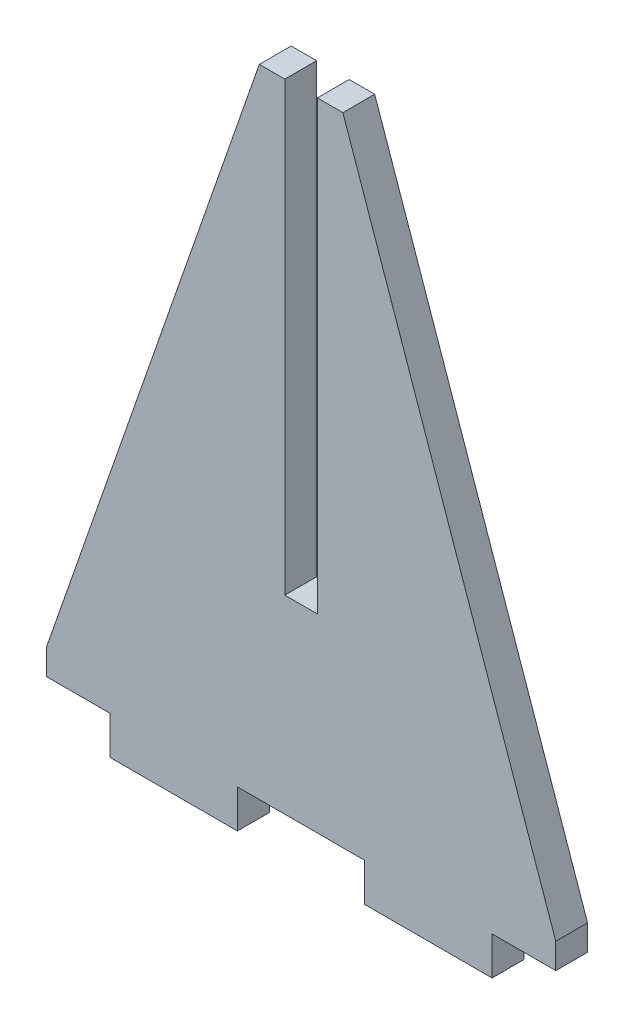
ISO-10303-21;
HEADER;
FILE_DESCRIPTION(('STEP AP214'),'2;1');
FILE_NAME('part.step','',(''),(''),'','','');
FILE_SCHEMA(('AUTOMOTIVE_DESIGN { 1 0 10303 214 1 1 1 1 }'));
ENDSEC;
DATA;
#1=APPLICATION_CONTEXT('core data for automotive mechanical design processes');
#2=APPLICATION_PROTOCOL_DEFINITION('international standard','automotive_design',2000,#1);
#3=PRODUCT_CONTEXT('',#1,'mechanical');
#4=PRODUCT('Part','Part','',(#3));
#5=PRODUCT_RELATED_PRODUCT_CATEGORY('part','',(#4));
#6=PRODUCT_DEFINITION_FORMATION('','',#4);
#7=PRODUCT_DEFINITION_CONTEXT('part definition',#1,'design');
#8=PRODUCT_DEFINITION('design','',#6,#7);
#9=PRODUCT_DEFINITION_SHAPE('','',#8);
#10=(LENGTH_UNIT() NAMED_UNIT(*) SI_UNIT(.MILLI.,.METRE.));
#11=(NAMED_UNIT(*) PLANE_ANGLE_UNIT() SI_UNIT($,.RADIAN.));
#12=(NAMED_UNIT(*) SI_UNIT($,.STERADIAN.) SOLID_ANGLE_UNIT());
#13=UNCERTAINTY_MEASURE_WITH_UNIT(LENGTH_MEASURE(1.E-05),#10,'distance_accuracy_value','');
#14=(GEOMETRIC_REPRESENTATION_CONTEXT(3) GLOBAL_UNCERTAINTY_ASSIGNED_CONTEXT((#13)) GLOBAL_UNIT_ASSIGNED_CONTEXT((#10,
#11,#12)) REPRESENTATION_CONTEXT('',''));
#15=CARTESIAN_POINT('',(0.,0.,0.));
#16=DIRECTION('',(0.,0.,1.));
#17=DIRECTION('',(1.,0.,0.));
#18=AXIS2_PLACEMENT_3D('',#15,#16,#17);
#19=CARTESIAN_POINT('',(19.05,-3.81,3.175));
#20=DIRECTION('',(-1.,0.,0.));
#21=DIRECTION('',(0.,-1.,0.));
#22=AXIS2_PLACEMENT_3D('',#19,#20,#21);
#23=PLANE('',#22);
#24=DIRECTION('',(0.,1.,0.));
#25=VECTOR('',#24,1.);
#26=CARTESIAN_POINT('',(19.05,-3.81,0.));
#27=LINE('',#26,#25);
#28=CARTESIAN_POINT('',(19.05,-3.81,0.));
#29=VERTEX_POINT('',#28);
#30=CARTESIAN_POINT('',(19.05,0.,0.));
#31=VERTEX_POINT('',#30);
#32=EDGE_CURVE('E194',#29,#31,#27,.T.);
#33=ORIENTED_EDGE('',*,*,#32,.T.);
#34=DIRECTION('',(0.,0.,-1.));
#35=VECTOR('',#34,1.);
#36=CARTESIAN_POINT('',(19.05,0.,3.175));
#37=LINE('',#36,#35);
#38=CARTESIAN_POINT('',(19.05,0.,3.175));
#39=VERTEX_POINT('',#38);
#40=EDGE_CURVE('E11',#39,#31,#37,.T.);
#41=ORIENTED_EDGE('',*,*,#40,.F.);
#42=DIRECTION('',(0.,1.,0.));
#43=VECTOR('',#42,1.);
#44=CARTESIAN_POINT('',(19.05,-3.81,3.175));
#45=LINE('',#44,#43);
#46=CARTESIAN_POINT('',(19.05,-3.81,3.175));
#47=VERTEX_POINT('',#46);
#48=EDGE_CURVE('E229',#47,#39,#45,.T.);
#49=ORIENTED_EDGE('',*,*,#48,.F.);
#50=DIRECTION('',(0.,0.,-1.));
#51=VECTOR('',#50,1.);
#52=CARTESIAN_POINT('',(19.05,-3.81,3.175));
#53=LINE('',#52,#51);
#54=EDGE_CURVE('E190',#47,#29,#53,.T.);
#55=ORIENTED_EDGE('',*,*,#54,.T.);
#56=EDGE_LOOP('',(#33,#41,#49,#55));
#57=FACE_BOUND('',#56,.T.);
#58=ADVANCED_FACE('F39',(#57),#23,.F.);
#59=CARTESIAN_POINT('',(19.05,0.,3.175));
#60=DIRECTION('',(0.,1.,0.));
#61=DIRECTION('',(0.,0.,1.));
#62=AXIS2_PLACEMENT_3D('',#59,#60,#61);
#63=PLANE('',#62);
#64=DIRECTION('',(1.,0.,0.));
#65=VECTOR('',#64,1.);
#66=CARTESIAN_POINT('',(19.05,0.,0.));
#67=LINE('',#66,#65);
#68=CARTESIAN_POINT('',(25.4,0.,0.));
#69=VERTEX_POINT('',#68);
#70=EDGE_CURVE('E197',#31,#69,#67,.T.);
#71=ORIENTED_EDGE('',*,*,#70,.T.);
#72=DIRECTION('',(0.,0.,-1.));
#73=VECTOR('',#72,1.);
#74=CARTESIAN_POINT('',(25.4,0.,3.175));
#75=LINE('',#74,#73);
#76=CARTESIAN_POINT('',(25.4,0.,3.175));
#77=VERTEX_POINT('',#76);
#78=EDGE_CURVE('E47',#77,#69,#75,.T.);
#79=ORIENTED_EDGE('',*,*,#78,.F.);
#80=DIRECTION('',(1.,0.,0.));
#81=VECTOR('',#80,1.);
#82=CARTESIAN_POINT('',(19.05,0.,3.175));
#83=LINE('',#82,#81);
#84=EDGE_CURVE('E128',#39,#77,#83,.T.);
#85=ORIENTED_EDGE('',*,*,#84,.F.);
#86=ORIENTED_EDGE('',*,*,#40,.T.);
#87=EDGE_LOOP('',(#71,#79,#85,#86));
#88=FACE_BOUND('',#87,.T.);
#89=ADVANCED_FACE('F338',(#88),#63,.F.);
#90=CARTESIAN_POINT('',(25.4,0.,3.175));
#91=DIRECTION('',(-1.,0.,0.));
#92=DIRECTION('',(0.,0.,1.));
#93=AXIS2_PLACEMENT_3D('',#90,#91,#92);
#94=PLANE('',#93);
#95=DIRECTION('',(0.,1.,0.));
#96=VECTOR('',#95,1.);
#97=CARTESIAN_POINT('',(25.4,0.,0.));
#98=LINE('',#97,#96);
#99=CARTESIAN_POINT('',(25.4,2.54,0.));
#100=VERTEX_POINT('',#99);
#101=EDGE_CURVE('E199',#69,#100,#98,.T.);
#102=ORIENTED_EDGE('',*,*,#101,.T.);
#103=DIRECTION('',(0.,0.,-1.));
#104=VECTOR('',#103,1.);
#105=CARTESIAN_POINT('',(25.4,2.54,3.175));
#106=LINE('',#105,#104);
#107=CARTESIAN_POINT('',(25.4,2.54,3.175));
#108=VERTEX_POINT('',#107);
#109=EDGE_CURVE('E266',#108,#100,#106,.T.);
#110=ORIENTED_EDGE('',*,*,#109,.F.);
#111=DIRECTION('',(0.,1.,0.));
#112=VECTOR('',#111,1.);
#113=CARTESIAN_POINT('',(25.4,0.,3.175));
#114=LINE('',#113,#112);
#115=EDGE_CURVE('E274',#77,#108,#114,.T.);
#116=ORIENTED_EDGE('',*,*,#115,.F.);
#117=ORIENTED_EDGE('',*,*,#78,.T.);
#118=EDGE_LOOP('',(#102,#110,#116,#117));
#119=FACE_BOUND('',#118,.T.);
#120=ADVANCED_FACE('F272',(#119),#94,.F.);
#121=CARTESIAN_POINT('',(25.4,2.54,3.175));
#122=DIRECTION('',(-0.944348067404514,-0.328947910145906,0.));
#123=DIRECTION('',(0.328947910145906,-0.944348067404514,0.));
#124=AXIS2_PLACEMENT_3D('',#121,#122,#123);
#125=PLANE('',#124);
#126=DIRECTION('',(-0.328947910145906,0.944348067404514,0.));
#127=VECTOR('',#126,1.);
#128=CARTESIAN_POINT('',(25.4,2.54,0.));
#129=LINE('',#128,#127);
#130=CARTESIAN_POINT('',(4.1656,63.5,0.));
#131=VERTEX_POINT('',#130);
#132=EDGE_CURVE('E201',#100,#131,#129,.T.);
#133=ORIENTED_EDGE('',*,*,#132,.T.);
#134=DIRECTION('',(0.,0.,-1.));
#135=VECTOR('',#134,1.);
#136=CARTESIAN_POINT('',(4.1656,63.5,3.175));
#137=LINE('',#136,#135);
#138=CARTESIAN_POINT('',(4.1656,63.5,3.175));
#139=VERTEX_POINT('',#138);
#140=EDGE_CURVE('E263',#139,#131,#137,.T.);
#141=ORIENTED_EDGE('',*,*,#140,.F.);
#142=DIRECTION('',(-0.328947910145906,0.944348067404514,0.));
#143=VECTOR('',#142,1.);
#144=CARTESIAN_POINT('',(25.4,2.54,3.175));
#145=LINE('',#144,#143);
#146=EDGE_CURVE('E292',#108,#139,#145,.T.);
#147=ORIENTED_EDGE('',*,*,#146,.F.);
#148=ORIENTED_EDGE('',*,*,#109,.T.);
#149=EDGE_LOOP('',(#133,#141,#147,#148));
#150=FACE_BOUND('',#149,.T.);
#151=ADVANCED_FACE('F283',(#150),#125,.F.);
#152=CARTESIAN_POINT('',(1.6256,63.5,3.175));
#153=DIRECTION('',(0.,-1.,0.));
#154=DIRECTION('',(0.,0.,-1.));
#155=AXIS2_PLACEMENT_3D('',#152,#153,#154);
#156=PLANE('',#155);
#157=DIRECTION('',(-1.,0.,0.));
#158=VECTOR('',#157,1.);
#159=CARTESIAN_POINT('',(1.6256,63.5,0.));
#160=LINE('',#159,#158);
#161=CARTESIAN_POINT('',(1.6256,63.5,0.));
#162=VERTEX_POINT('',#161);
#163=EDGE_CURVE('E203',#131,#162,#160,.T.);
#164=ORIENTED_EDGE('',*,*,#163,.T.);
#165=DIRECTION('',(0.,0.,-1.));
#166=VECTOR('',#165,1.);
#167=CARTESIAN_POINT('',(1.6256,63.5,3.175));
#168=LINE('',#167,#166);
#169=CARTESIAN_POINT('',(1.6256,63.5,3.175));
#170=VERTEX_POINT('',#169);
#171=EDGE_CURVE('E260',#170,#162,#168,.T.);
#172=ORIENTED_EDGE('',*,*,#171,.F.);
#173=DIRECTION('',(-1.,0.,0.));
#174=VECTOR('',#173,1.);
#175=CARTESIAN_POINT('',(1.6256,63.5,3.175));
#176=LINE('',#175,#174);
#177=EDGE_CURVE('E289',#139,#170,#176,.T.);
#178=ORIENTED_EDGE('',*,*,#177,.F.);
#179=ORIENTED_EDGE('',*,*,#140,.T.);
#180=EDGE_LOOP('',(#164,#172,#178,#179));
#181=FACE_BOUND('',#180,.T.);
#182=ADVANCED_FACE('F287',(#181),#156,.F.);
#183=CARTESIAN_POINT('',(1.6256,18.923,3.175));
#184=DIRECTION('',(1.,0.,0.));
#185=DIRECTION('',(0.,0.,-1.));
#186=AXIS2_PLACEMENT_3D('',#183,#184,#185);
#187=PLANE('',#186);
#188=DIRECTION('',(0.,-1.,0.));
#189=VECTOR('',#188,1.);
#190=CARTESIAN_POINT('',(1.6256,18.923,0.));
#191=LINE('',#190,#189);
#192=CARTESIAN_POINT('',(1.6256,18.923,0.));
#193=VERTEX_POINT('',#192);
#194=EDGE_CURVE('E205',#162,#193,#191,.T.);
#195=ORIENTED_EDGE('',*,*,#194,.T.);
#196=DIRECTION('',(0.,0.,-1.));
#197=VECTOR('',#196,1.);
#198=CARTESIAN_POINT('',(1.6256,18.923,3.175));
#199=LINE('',#198,#197);
#200=CARTESIAN_POINT('',(1.6256,18.923,3.175));
#201=VERTEX_POINT('',#200);
#202=EDGE_CURVE('E257',#201,#193,#199,.T.);
#203=ORIENTED_EDGE('',*,*,#202,.F.);
#204=DIRECTION('',(0.,-1.,0.));
#205=VECTOR('',#204,1.);
#206=CARTESIAN_POINT('',(1.6256,18.923,3.175));
#207=LINE('',#206,#205);
#208=EDGE_CURVE('E291',#170,#201,#207,.T.);
#209=ORIENTED_EDGE('',*,*,#208,.F.);
#210=ORIENTED_EDGE('',*,*,#171,.T.);
#211=EDGE_LOOP('',(#195,#203,#209,#210));
#212=FACE_BOUND('',#211,.T.);
#213=ADVANCED_FACE('F351',(#212),#187,.F.);
#214=CARTESIAN_POINT('',(1.6256,18.923,3.175));
#215=DIRECTION('',(0.,-1.,0.));
#216=DIRECTION('',(0.,0.,-1.));
#217=AXIS2_PLACEMENT_3D('',#214,#215,#216);
#218=PLANE('',#217);
#219=DIRECTION('',(-1.,0.,0.));
#220=VECTOR('',#219,1.);
#221=CARTESIAN_POINT('',(1.6256,18.923,0.));
#222=LINE('',#221,#220);
#223=CARTESIAN_POINT('',(-1.6256,18.923,0.));
#224=VERTEX_POINT('',#223);
#225=EDGE_CURVE('E207',#193,#224,#222,.T.);
#226=ORIENTED_EDGE('',*,*,#225,.T.);
#227=DIRECTION('',(0.,0.,-1.));
#228=VECTOR('',#227,1.);
#229=CARTESIAN_POINT('',(-1.6256,18.923,3.175));
#230=LINE('',#229,#228);
#231=CARTESIAN_POINT('',(-1.6256,18.923,3.175));
#232=VERTEX_POINT('',#231);
#233=EDGE_CURVE('E254',#232,#224,#230,.T.);
#234=ORIENTED_EDGE('',*,*,#233,.F.);
#235=DIRECTION('',(-1.,0.,0.));
#236=VECTOR('',#235,1.);
#237=CARTESIAN_POINT('',(1.6256,18.923,3.175));
#238=LINE('',#237,#236);
#239=EDGE_CURVE('E294',#201,#232,#238,.T.);
#240=ORIENTED_EDGE('',*,*,#239,.F.);
#241=ORIENTED_EDGE('',*,*,#202,.T.);
#242=EDGE_LOOP('',(#226,#234,#240,#241));
#243=FACE_BOUND('',#242,.T.);
#244=ADVANCED_FACE('F354',(#243),#218,.F.);
#245=CARTESIAN_POINT('',(-1.6256,18.923,3.175));
#246=DIRECTION('',(-1.,0.,0.));
#247=DIRECTION('',(0.,0.,1.));
#248=AXIS2_PLACEMENT_3D('',#245,#246,#247);
#249=PLANE('',#248);
#250=DIRECTION('',(0.,1.,0.));
#251=VECTOR('',#250,1.);
#252=CARTESIAN_POINT('',(-1.6256,18.923,0.));
#253=LINE('',#252,#251);
#254=CARTESIAN_POINT('',(-1.6256,63.5,0.));
#255=VERTEX_POINT('',#254);
#256=EDGE_CURVE('E209',#224,#255,#253,.T.);
#257=ORIENTED_EDGE('',*,*,#256,.T.);
#258=DIRECTION('',(0.,0.,-1.));
#259=VECTOR('',#258,1.);
#260=CARTESIAN_POINT('',(-1.6256,63.5,3.175));
#261=LINE('',#260,#259);
#262=CARTESIAN_POINT('',(-1.6256,63.5,3.175));
#263=VERTEX_POINT('',#262);
#264=EDGE_CURVE('E251',#263,#255,#261,.T.);
#265=ORIENTED_EDGE('',*,*,#264,.F.);
#266=DIRECTION('',(0.,1.,0.));
#267=VECTOR('',#266,1.);
#268=CARTESIAN_POINT('',(-1.6256,18.923,3.175));
#269=LINE('',#268,#267);
#270=EDGE_CURVE('E300',#232,#263,#269,.T.);
#271=ORIENTED_EDGE('',*,*,#270,.F.);
#272=ORIENTED_EDGE('',*,*,#233,.T.);
#273=EDGE_LOOP('',(#257,#265,#271,#272));
#274=FACE_BOUND('',#273,.T.);
#275=ADVANCED_FACE('F358',(#274),#249,.F.);
#276=CARTESIAN_POINT('',(-1.6256,63.5,3.175));
#277=DIRECTION('',(0.,-1.,0.));
#278=DIRECTION('',(1.,0.,0.));
#279=AXIS2_PLACEMENT_3D('',#276,#277,#278);
#280=PLANE('',#279);
#281=DIRECTION('',(-1.,0.,0.));
#282=VECTOR('',#281,1.);
#283=CARTESIAN_POINT('',(-1.6256,63.5,0.));
#284=LINE('',#283,#282);
#285=CARTESIAN_POINT('',(-4.1656,63.5,0.));
#286=VERTEX_POINT('',#285);
#287=EDGE_CURVE('E211',#255,#286,#284,.T.);
#288=ORIENTED_EDGE('',*,*,#287,.T.);
#289=DIRECTION('',(0.,0.,-1.));
#290=VECTOR('',#289,1.);
#291=CARTESIAN_POINT('',(-4.1656,63.5,3.175));
#292=LINE('',#291,#290);
#293=CARTESIAN_POINT('',(-4.1656,63.5,3.175));
#294=VERTEX_POINT('',#293);
#295=EDGE_CURVE('E248',#294,#286,#292,.T.);
#296=ORIENTED_EDGE('',*,*,#295,.F.);
#297=DIRECTION('',(-1.,0.,0.));
#298=VECTOR('',#297,1.);
#299=CARTESIAN_POINT('',(-1.6256,63.5,3.175));
#300=LINE('',#299,#298);
#301=EDGE_CURVE('E302',#263,#294,#300,.T.);
#302=ORIENTED_EDGE('',*,*,#301,.F.);
#303=ORIENTED_EDGE('',*,*,#264,.T.);
#304=EDGE_LOOP('',(#288,#296,#302,#303));
#305=FACE_BOUND('',#304,.T.);
#306=ADVANCED_FACE('F362',(#305),#280,.F.);
#307=CARTESIAN_POINT('',(-25.4,2.54,3.175));
#308=DIRECTION('',(0.944348067404514,-0.328947910145906,0.));
#309=DIRECTION('',(0.328947910145906,0.944348067404514,0.));
#310=AXIS2_PLACEMENT_3D('',#307,#308,#309);
#311=PLANE('',#310);
#312=DIRECTION('',(-0.328947910145906,-0.944348067404514,0.));
#313=VECTOR('',#312,1.);
#314=CARTESIAN_POINT('',(-25.4,2.54,0.));
#315=LINE('',#314,#313);
#316=CARTESIAN_POINT('',(-25.4,2.54,0.));
#317=VERTEX_POINT('',#316);
#318=EDGE_CURVE('E213',#286,#317,#315,.T.);
#319=ORIENTED_EDGE('',*,*,#318,.T.);
#320=DIRECTION('',(0.,0.,-1.));
#321=VECTOR('',#320,1.);
#322=CARTESIAN_POINT('',(-25.4,2.54,3.175));
#323=LINE('',#322,#321);
#324=CARTESIAN_POINT('',(-25.4,2.54,3.175));
#325=VERTEX_POINT('',#324);
#326=EDGE_CURVE('E245',#325,#317,#323,.T.);
#327=ORIENTED_EDGE('',*,*,#326,.F.);
#328=DIRECTION('',(-0.328947910145906,-0.944348067404514,0.));
#329=VECTOR('',#328,1.);
#330=CARTESIAN_POINT('',(-25.4,2.54,3.175));
#331=LINE('',#330,#329);
#332=EDGE_CURVE('E304',#294,#325,#331,.T.);
#333=ORIENTED_EDGE('',*,*,#332,.F.);
#334=ORIENTED_EDGE('',*,*,#295,.T.);
#335=EDGE_LOOP('',(#319,#327,#333,#334));
#336=FACE_BOUND('',#335,.T.);
#337=ADVANCED_FACE('F366',(#336),#311,.F.);
#338=CARTESIAN_POINT('',(-25.4,0.,3.175));
#339=DIRECTION('',(1.,0.,0.));
#340=DIRECTION('',(0.,0.,-1.));
#341=AXIS2_PLACEMENT_3D('',#338,#339,#340);
#342=PLANE('',#341);
#343=DIRECTION('',(0.,-1.,0.));
#344=VECTOR('',#343,1.);
#345=CARTESIAN_POINT('',(-25.4,0.,0.));
#346=LINE('',#345,#344);
#347=CARTESIAN_POINT('',(-25.4,0.,0.));
#348=VERTEX_POINT('',#347);
#349=EDGE_CURVE('E215',#317,#348,#346,.T.);
#350=ORIENTED_EDGE('',*,*,#349,.T.);
#351=DIRECTION('',(0.,0.,-1.));
#352=VECTOR('',#351,1.);
#353=CARTESIAN_POINT('',(-25.4,0.,3.175));
#354=LINE('',#353,#352);
#355=CARTESIAN_POINT('',(-25.4,0.,3.175));
#356=VERTEX_POINT('',#355);
#357=EDGE_CURVE('E242',#356,#348,#354,.T.);
#358=ORIENTED_EDGE('',*,*,#357,.F.);
#359=DIRECTION('',(0.,-1.,0.));
#360=VECTOR('',#359,1.);
#361=CARTESIAN_POINT('',(-25.4,0.,3.175));
#362=LINE('',#361,#360);
#363=EDGE_CURVE('E306',#325,#356,#362,.T.);
#364=ORIENTED_EDGE('',*,*,#363,.F.);
#365=ORIENTED_EDGE('',*,*,#326,.T.);
#366=EDGE_LOOP('',(#350,#358,#364,#365));
#367=FACE_BOUND('',#366,.T.);
#368=ADVANCED_FACE('F370',(#367),#342,.F.);
#369=CARTESIAN_POINT('',(-19.05,0.,3.175));
#370=DIRECTION('',(0.,1.,0.));
#371=DIRECTION('',(-1.,0.,0.));
#372=AXIS2_PLACEMENT_3D('',#369,#370,#371);
#373=PLANE('',#372);
#374=DIRECTION('',(1.,0.,0.));
#375=VECTOR('',#374,1.);
#376=CARTESIAN_POINT('',(-19.05,0.,0.));
#377=LINE('',#376,#375);
#378=CARTESIAN_POINT('',(-19.05,0.,0.));
#379=VERTEX_POINT('',#378);
#380=EDGE_CURVE('E217',#348,#379,#377,.T.);
#381=ORIENTED_EDGE('',*,*,#380,.T.);
#382=DIRECTION('',(0.,0.,-1.));
#383=VECTOR('',#382,1.);
#384=CARTESIAN_POINT('',(-19.05,0.,3.175));
#385=LINE('',#384,#383);
#386=CARTESIAN_POINT('',(-19.05,0.,3.175));
#387=VERTEX_POINT('',#386);
#388=EDGE_CURVE('E239',#387,#379,#385,.T.);
#389=ORIENTED_EDGE('',*,*,#388,.F.);
#390=DIRECTION('',(1.,0.,0.));
#391=VECTOR('',#390,1.);
#392=CARTESIAN_POINT('',(-19.05,0.,3.175));
#393=LINE('',#392,#391);
#394=EDGE_CURVE('E308',#356,#387,#393,.T.);
#395=ORIENTED_EDGE('',*,*,#394,.F.);
#396=ORIENTED_EDGE('',*,*,#357,.T.);
#397=EDGE_LOOP('',(#381,#389,#395,#396));
#398=FACE_BOUND('',#397,.T.);
#399=ADVANCED_FACE('F374',(#398),#373,.F.);
#400=CARTESIAN_POINT('',(-19.05,0.,3.175));
#401=DIRECTION('',(1.,0.,0.));
#402=DIRECTION('',(0.,0.,-1.));
#403=AXIS2_PLACEMENT_3D('',#400,#401,#402);
#404=PLANE('',#403);
#405=DIRECTION('',(0.,-1.,0.));
#406=VECTOR('',#405,1.);
#407=CARTESIAN_POINT('',(-19.05,0.,0.));
#408=LINE('',#407,#406);
#409=CARTESIAN_POINT('',(-19.05,-3.81,0.));
#410=VERTEX_POINT('',#409);
#411=EDGE_CURVE('E219',#379,#410,#408,.T.);
#412=ORIENTED_EDGE('',*,*,#411,.T.);
#413=DIRECTION('',(0.,0.,-1.));
#414=VECTOR('',#413,1.);
#415=CARTESIAN_POINT('',(-19.05,-3.81,3.175));
#416=LINE('',#415,#414);
#417=CARTESIAN_POINT('',(-19.05,-3.81,3.175));
#418=VERTEX_POINT('',#417);
#419=EDGE_CURVE('E236',#418,#410,#416,.T.);
#420=ORIENTED_EDGE('',*,*,#419,.F.);
#421=DIRECTION('',(0.,-1.,0.));
#422=VECTOR('',#421,1.);
#423=CARTESIAN_POINT('',(-19.05,0.,3.175));
#424=LINE('',#423,#422);
#425=EDGE_CURVE('E310',#387,#418,#424,.T.);
#426=ORIENTED_EDGE('',*,*,#425,.F.);
#427=ORIENTED_EDGE('',*,*,#388,.T.);
#428=EDGE_LOOP('',(#412,#420,#426,#427));
#429=FACE_BOUND('',#428,.T.);
#430=ADVANCED_FACE('F378',(#429),#404,.F.);
#431=CARTESIAN_POINT('',(-19.05,-3.81,3.175));
#432=DIRECTION('',(0.,1.,0.));
#433=DIRECTION('',(-1.,0.,0.));
#434=AXIS2_PLACEMENT_3D('',#431,#432,#433);
#435=PLANE('',#434);
#436=DIRECTION('',(1.,0.,0.));
#437=VECTOR('',#436,1.);
#438=CARTESIAN_POINT('',(-19.05,-3.81,0.));
#439=LINE('',#438,#437);
#440=CARTESIAN_POINT('',(-6.35,-3.81,0.));
#441=VERTEX_POINT('',#440);
#442=EDGE_CURVE('E221',#410,#441,#439,.T.);
#443=ORIENTED_EDGE('',*,*,#442,.T.);
#444=DIRECTION('',(0.,0.,-1.));
#445=VECTOR('',#444,1.);
#446=CARTESIAN_POINT('',(-6.35,-3.81,3.175));
#447=LINE('',#446,#445);
#448=CARTESIAN_POINT('',(-6.35,-3.81,3.175));
#449=VERTEX_POINT('',#448);
#450=EDGE_CURVE('E233',#449,#441,#447,.T.);
#451=ORIENTED_EDGE('',*,*,#450,.F.);
#452=DIRECTION('',(1.,0.,0.));
#453=VECTOR('',#452,1.);
#454=CARTESIAN_POINT('',(-19.05,-3.81,3.175));
#455=LINE('',#454,#453);
#456=EDGE_CURVE('E312',#418,#449,#455,.T.);
#457=ORIENTED_EDGE('',*,*,#456,.F.);
#458=ORIENTED_EDGE('',*,*,#419,.T.);
#459=EDGE_LOOP('',(#443,#451,#457,#458));
#460=FACE_BOUND('',#459,.T.);
#461=ADVANCED_FACE('F318',(#460),#435,.F.);
#462=CARTESIAN_POINT('',(-6.35,-3.81,3.175));
#463=DIRECTION('',(-1.,0.,0.));
#464=DIRECTION('',(0.,-1.,0.));
#465=AXIS2_PLACEMENT_3D('',#462,#463,#464);
#466=PLANE('',#465);
#467=DIRECTION('',(0.,1.,0.));
#468=VECTOR('',#467,1.);
#469=CARTESIAN_POINT('',(-6.35,-3.81,0.));
#470=LINE('',#469,#468);
#471=CARTESIAN_POINT('',(-6.35,0.,0.));
#472=VERTEX_POINT('',#471);
#473=EDGE_CURVE('E223',#441,#472,#470,.T.);
#474=ORIENTED_EDGE('',*,*,#473,.T.);
#475=DIRECTION('',(0.,0.,-1.));
#476=VECTOR('',#475,1.);
#477=CARTESIAN_POINT('',(-6.35,0.,3.175));
#478=LINE('',#477,#476);
#479=CARTESIAN_POINT('',(-6.35,0.,3.175));
#480=VERTEX_POINT('',#479);
#481=EDGE_CURVE('E185',#480,#472,#478,.T.);
#482=ORIENTED_EDGE('',*,*,#481,.F.);
#483=DIRECTION('',(0.,1.,0.));
#484=VECTOR('',#483,1.);
#485=CARTESIAN_POINT('',(-6.35,-3.81,3.175));
#486=LINE('',#485,#484);
#487=EDGE_CURVE('E177',#449,#480,#486,.T.);
#488=ORIENTED_EDGE('',*,*,#487,.F.);
#489=ORIENTED_EDGE('',*,*,#450,.T.);
#490=EDGE_LOOP('',(#474,#482,#488,#489));
#491=FACE_BOUND('',#490,.T.);
#492=ADVANCED_FACE('F322',(#491),#466,.F.);
#493=CARTESIAN_POINT('',(0.,0.,3.175));
#494=DIRECTION('',(0.,1.,0.));
#495=DIRECTION('',(0.,0.,1.));
#496=AXIS2_PLACEMENT_3D('',#493,#494,#495);
#497=PLANE('',#496);
#498=DIRECTION('',(1.,0.,0.));
#499=VECTOR('',#498,1.);
#500=CARTESIAN_POINT('',(0.,0.,0.));
#501=LINE('',#500,#499);
#502=CARTESIAN_POINT('',(6.35,0.,0.));
#503=VERTEX_POINT('',#502);
#504=EDGE_CURVE('E184',#472,#503,#501,.T.);
#505=ORIENTED_EDGE('',*,*,#504,.T.);
#506=DIRECTION('',(0.,0.,-1.));
#507=VECTOR('',#506,1.);
#508=CARTESIAN_POINT('',(6.35,0.,3.175));
#509=LINE('',#508,#507);
#510=CARTESIAN_POINT('',(6.35,0.,3.175));
#511=VERTEX_POINT('',#510);
#512=EDGE_CURVE('E182',#511,#503,#509,.T.);
#513=ORIENTED_EDGE('',*,*,#512,.F.);
#514=DIRECTION('',(1.,0.,0.));
#515=VECTOR('',#514,1.);
#516=CARTESIAN_POINT('',(-6.35,0.,3.175));
#517=LINE('',#516,#515);
#518=EDGE_CURVE('E171',#480,#511,#517,.T.);
#519=ORIENTED_EDGE('',*,*,#518,.F.);
#520=ORIENTED_EDGE('',*,*,#481,.T.);
#521=EDGE_LOOP('',(#505,#513,#519,#520));
#522=FACE_BOUND('',#521,.T.);
#523=ADVANCED_FACE('F183',(#522),#497,.F.);
#524=CARTESIAN_POINT('',(6.35,0.,3.175));
#525=DIRECTION('',(1.,0.,0.));
#526=DIRECTION('',(0.,1.,0.));
#527=AXIS2_PLACEMENT_3D('',#524,#525,#526);
#528=PLANE('',#527);
#529=DIRECTION('',(0.,-1.,0.));
#530=VECTOR('',#529,1.);
#531=CARTESIAN_POINT('',(6.35,0.,0.));
#532=LINE('',#531,#530);
#533=CARTESIAN_POINT('',(6.35,-3.81,0.));
#534=VERTEX_POINT('',#533);
#535=EDGE_CURVE('E114',#503,#534,#532,.T.);
#536=ORIENTED_EDGE('',*,*,#535,.T.);
#537=DIRECTION('',(0.,0.,-1.));
#538=VECTOR('',#537,1.);
#539=CARTESIAN_POINT('',(6.35,-3.81,3.175));
#540=LINE('',#539,#538);
#541=CARTESIAN_POINT('',(6.35,-3.81,3.175));
#542=VERTEX_POINT('',#541);
#543=EDGE_CURVE('E186',#542,#534,#540,.T.);
#544=ORIENTED_EDGE('',*,*,#543,.F.);
#545=DIRECTION('',(0.,-1.,0.));
#546=VECTOR('',#545,1.);
#547=CARTESIAN_POINT('',(6.35,0.,3.175));
#548=LINE('',#547,#546);
#549=EDGE_CURVE('E175',#511,#542,#548,.T.);
#550=ORIENTED_EDGE('',*,*,#549,.F.);
#551=ORIENTED_EDGE('',*,*,#512,.T.);
#552=EDGE_LOOP('',(#536,#544,#550,#551));
#553=FACE_BOUND('',#552,.T.);
#554=ADVANCED_FACE('F188',(#553),#528,.F.);
#555=CARTESIAN_POINT('',(6.35,-3.81,3.175));
#556=DIRECTION('',(0.,1.,0.));
#557=DIRECTION('',(-1.,0.,0.));
#558=AXIS2_PLACEMENT_3D('',#555,#556,#557);
#559=PLANE('',#558);
#560=DIRECTION('',(1.,0.,0.));
#561=VECTOR('',#560,1.);
#562=CARTESIAN_POINT('',(6.35,-3.81,0.));
#563=LINE('',#562,#561);
#564=EDGE_CURVE('E120',#534,#29,#563,.T.);
#565=ORIENTED_EDGE('',*,*,#564,.T.);
#566=ORIENTED_EDGE('',*,*,#54,.F.);
#567=DIRECTION('',(1.,0.,0.));
#568=VECTOR('',#567,1.);
#569=CARTESIAN_POINT('',(6.35,-3.81,3.175));
#570=LINE('',#569,#568);
#571=EDGE_CURVE('E55',#542,#47,#570,.T.);
#572=ORIENTED_EDGE('',*,*,#571,.F.);
#573=ORIENTED_EDGE('',*,*,#543,.T.);
#574=EDGE_LOOP('',(#565,#566,#572,#573));
#575=FACE_BOUND('',#574,.T.);
#576=ADVANCED_FACE('F327',(#575),#559,.F.);
#577=CARTESIAN_POINT('',(0.,0.,3.175));
#578=DIRECTION('',(0.,0.,-1.));
#579=DIRECTION('',(-1.,0.,0.));
#580=AXIS2_PLACEMENT_3D('',#577,#578,#579);
#581=PLANE('',#580);
#582=ORIENTED_EDGE('',*,*,#48,.T.);
#583=ORIENTED_EDGE('',*,*,#84,.T.);
#584=ORIENTED_EDGE('',*,*,#115,.T.);
#585=ORIENTED_EDGE('',*,*,#146,.T.);
#586=ORIENTED_EDGE('',*,*,#177,.T.);
#587=ORIENTED_EDGE('',*,*,#208,.T.);
#588=ORIENTED_EDGE('',*,*,#239,.T.);
#589=ORIENTED_EDGE('',*,*,#270,.T.);
#590=ORIENTED_EDGE('',*,*,#301,.T.);
#591=ORIENTED_EDGE('',*,*,#332,.T.);
#592=ORIENTED_EDGE('',*,*,#363,.T.);
#593=ORIENTED_EDGE('',*,*,#394,.T.);
#594=ORIENTED_EDGE('',*,*,#425,.T.);
#595=ORIENTED_EDGE('',*,*,#456,.T.);
#596=ORIENTED_EDGE('',*,*,#487,.T.);
#597=ORIENTED_EDGE('',*,*,#518,.T.);
#598=ORIENTED_EDGE('',*,*,#549,.T.);
#599=ORIENTED_EDGE('',*,*,#571,.T.);
#600=EDGE_LOOP('',(#582,#583,#584,#585,#586,#587,#588,#589,#590,#591,#592,#593,#594,#595,#596,
#597,#598,#599));
#601=FACE_BOUND('',#600,.T.);
#602=ADVANCED_FACE('F173',(#601),#581,.F.);
#603=CARTESIAN_POINT('',(0.,0.,0.));
#604=DIRECTION('',(0.,0.,-1.));
#605=DIRECTION('',(-1.,0.,0.));
#606=AXIS2_PLACEMENT_3D('',#603,#604,#605);
#607=PLANE('',#606);
#608=ORIENTED_EDGE('',*,*,#32,.F.);
#609=ORIENTED_EDGE('',*,*,#564,.F.);
#610=ORIENTED_EDGE('',*,*,#535,.F.);
#611=ORIENTED_EDGE('',*,*,#504,.F.);
#612=ORIENTED_EDGE('',*,*,#473,.F.);
#613=ORIENTED_EDGE('',*,*,#442,.F.);
#614=ORIENTED_EDGE('',*,*,#411,.F.);
#615=ORIENTED_EDGE('',*,*,#380,.F.);
#616=ORIENTED_EDGE('',*,*,#349,.F.);
#617=ORIENTED_EDGE('',*,*,#318,.F.);
#618=ORIENTED_EDGE('',*,*,#287,.F.);
#619=ORIENTED_EDGE('',*,*,#256,.F.);
#620=ORIENTED_EDGE('',*,*,#225,.F.);
#621=ORIENTED_EDGE('',*,*,#194,.F.);
#622=ORIENTED_EDGE('',*,*,#163,.F.);
#623=ORIENTED_EDGE('',*,*,#132,.F.);
#624=ORIENTED_EDGE('',*,*,#101,.F.);
#625=ORIENTED_EDGE('',*,*,#70,.F.);
#626=EDGE_LOOP('',(#608,#609,#610,#611,#612,#613,#614,#615,#616,#617,#618,#619,#620,#621,#622,
#623,#624,#625));
#627=FACE_BOUND('',#626,.T.);
#628=ADVANCED_FACE('F278',(#627),#607,.T.);
#629=CLOSED_SHELL('',(#58,#89,#120,#151,#182,#213,#244,#275,#306,#337,#368,#399,#430,#461,#492,
#523,#554,#576,#602,#628));
#630=MANIFOLD_SOLID_BREP('B2',#629);
#631=ADVANCED_BREP_SHAPE_REPRESENTATION('',(#18,#630),#14);
#632=SHAPE_DEFINITION_REPRESENTATION(#9,#631);
ENDSEC;
END-ISO-10303-21;
